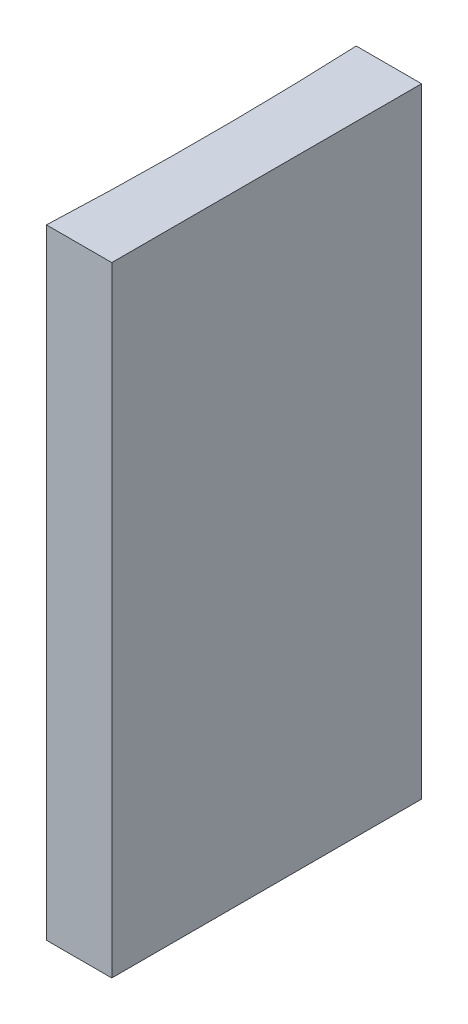
ISO-10303-21;
HEADER;
FILE_DESCRIPTION(('STEP AP214'),'2;1');
FILE_NAME('part.step','',(''),(''),'','','');
FILE_SCHEMA(('AUTOMOTIVE_DESIGN { 1 0 10303 214 1 1 1 1 }'));
ENDSEC;
DATA;
#1=APPLICATION_CONTEXT('core data for automotive mechanical design processes');
#2=APPLICATION_PROTOCOL_DEFINITION('international standard','automotive_design',2000,#1);
#3=PRODUCT_CONTEXT('',#1,'mechanical');
#4=PRODUCT('Part','Part','',(#3));
#5=PRODUCT_RELATED_PRODUCT_CATEGORY('part','',(#4));
#6=PRODUCT_DEFINITION_FORMATION('','',#4);
#7=PRODUCT_DEFINITION_CONTEXT('part definition',#1,'design');
#8=PRODUCT_DEFINITION('design','',#6,#7);
#9=PRODUCT_DEFINITION_SHAPE('','',#8);
#10=(LENGTH_UNIT() NAMED_UNIT(*) SI_UNIT(.MILLI.,.METRE.));
#11=(NAMED_UNIT(*) PLANE_ANGLE_UNIT() SI_UNIT($,.RADIAN.));
#12=(NAMED_UNIT(*) SI_UNIT($,.STERADIAN.) SOLID_ANGLE_UNIT());
#13=UNCERTAINTY_MEASURE_WITH_UNIT(LENGTH_MEASURE(1.E-05),#10,'distance_accuracy_value','');
#14=(GEOMETRIC_REPRESENTATION_CONTEXT(3) GLOBAL_UNCERTAINTY_ASSIGNED_CONTEXT((#13)) GLOBAL_UNIT_ASSIGNED_CONTEXT((#10,
#11,#12)) REPRESENTATION_CONTEXT('',''));
#15=CARTESIAN_POINT('',(0.,0.,0.));
#16=DIRECTION('',(0.,0.,1.));
#17=DIRECTION('',(1.,0.,0.));
#18=AXIS2_PLACEMENT_3D('',#15,#16,#17);
#19=CARTESIAN_POINT('',(0.,20.,0.));
#20=DIRECTION('',(0.,0.,1.));
#21=DIRECTION('',(1.,0.,0.));
#22=AXIS2_PLACEMENT_3D('',#19,#20,#21);
#23=PLANE('',#22);
#24=DIRECTION('',(-1.,0.,0.));
#25=VECTOR('',#24,1.);
#26=CARTESIAN_POINT('',(0.,0.,0.));
#27=LINE('',#26,#25);
#28=CARTESIAN_POINT('',(0.,0.,0.));
#29=VERTEX_POINT('',#28);
#30=CARTESIAN_POINT('',(-2.109107941646,0.,0.));
#31=VERTEX_POINT('',#30);
#32=EDGE_CURVE('E100',#29,#31,#27,.T.);
#33=ORIENTED_EDGE('',*,*,#32,.T.);
#34=DIRECTION('',(0.,-1.,0.));
#35=VECTOR('',#34,1.);
#36=CARTESIAN_POINT('',(-2.109107941646,20.,0.));
#37=LINE('',#36,#35);
#38=CARTESIAN_POINT('',(-2.109107941646,20.,0.));
#39=VERTEX_POINT('',#38);
#40=EDGE_CURVE('E11',#39,#31,#37,.T.);
#41=ORIENTED_EDGE('',*,*,#40,.F.);
#42=DIRECTION('',(-1.,0.,0.));
#43=VECTOR('',#42,1.);
#44=CARTESIAN_POINT('',(0.,20.,0.));
#45=LINE('',#44,#43);
#46=CARTESIAN_POINT('',(0.,20.,0.));
#47=VERTEX_POINT('',#46);
#48=EDGE_CURVE('E88',#47,#39,#45,.T.);
#49=ORIENTED_EDGE('',*,*,#48,.F.);
#50=DIRECTION('',(0.,-1.,0.));
#51=VECTOR('',#50,1.);
#52=CARTESIAN_POINT('',(0.,20.,0.));
#53=LINE('',#52,#51);
#54=EDGE_CURVE('E96',#47,#29,#53,.T.);
#55=ORIENTED_EDGE('',*,*,#54,.T.);
#56=EDGE_LOOP('',(#33,#41,#49,#55));
#57=FACE_BOUND('',#56,.T.);
#58=ADVANCED_FACE('F37',(#57),#23,.F.);
#59=CARTESIAN_POINT('',(-116.62,20.,5.00000000000001));
#60=DIRECTION('',(0.,-1.,0.));
#61=DIRECTION('',(0.,0.,-1.));
#62=AXIS2_PLACEMENT_3D('',#59,#60,#61);
#63=CYLINDRICAL_SURFACE('',#62,114.62);
#64=CARTESIAN_POINT('',(-116.62,0.,5.00000000000001));
#65=DIRECTION('',(0.,-1.,0.));
#66=DIRECTION('',(0.,0.,1.));
#67=AXIS2_PLACEMENT_3D('',#64,#65,#66);
#68=CIRCLE('',#67,114.62);
#69=CARTESIAN_POINT('',(-2.10910794164601,0.,10.));
#70=VERTEX_POINT('',#69);
#71=EDGE_CURVE('E92',#31,#70,#68,.T.);
#72=ORIENTED_EDGE('',*,*,#71,.T.);
#73=DIRECTION('',(0.,-1.,0.));
#74=VECTOR('',#73,1.);
#75=CARTESIAN_POINT('',(-2.10910794164601,20.,10.));
#76=LINE('',#75,#74);
#77=CARTESIAN_POINT('',(-2.10910794164601,20.,10.));
#78=VERTEX_POINT('',#77);
#79=EDGE_CURVE('E45',#78,#70,#76,.T.);
#80=ORIENTED_EDGE('',*,*,#79,.F.);
#81=CARTESIAN_POINT('',(-116.62,20.,5.00000000000001));
#82=DIRECTION('',(0.,-1.,0.));
#83=DIRECTION('',(0.,0.,1.));
#84=AXIS2_PLACEMENT_3D('',#81,#82,#83);
#85=CIRCLE('',#84,114.62);
#86=EDGE_CURVE('E83',#39,#78,#85,.T.);
#87=ORIENTED_EDGE('',*,*,#86,.F.);
#88=ORIENTED_EDGE('',*,*,#40,.T.);
#89=EDGE_LOOP('',(#72,#80,#87,#88));
#90=FACE_BOUND('',#89,.T.);
#91=ADVANCED_FACE('F91',(#90),#63,.F.);
#92=CARTESIAN_POINT('',(0.,20.,10.));
#93=DIRECTION('',(0.,0.,-1.));
#94=DIRECTION('',(-1.,0.,0.));
#95=AXIS2_PLACEMENT_3D('',#92,#93,#94);
#96=PLANE('',#95);
#97=DIRECTION('',(1.,0.,0.));
#98=VECTOR('',#97,1.);
#99=CARTESIAN_POINT('',(0.,0.,10.));
#100=LINE('',#99,#98);
#101=CARTESIAN_POINT('',(0.,0.,10.));
#102=VERTEX_POINT('',#101);
#103=EDGE_CURVE('E70',#70,#102,#100,.T.);
#104=ORIENTED_EDGE('',*,*,#103,.T.);
#105=DIRECTION('',(0.,-1.,0.));
#106=VECTOR('',#105,1.);
#107=CARTESIAN_POINT('',(0.,20.,10.));
#108=LINE('',#107,#106);
#109=CARTESIAN_POINT('',(0.,20.,10.));
#110=VERTEX_POINT('',#109);
#111=EDGE_CURVE('E93',#110,#102,#108,.T.);
#112=ORIENTED_EDGE('',*,*,#111,.F.);
#113=DIRECTION('',(1.,0.,0.));
#114=VECTOR('',#113,1.);
#115=CARTESIAN_POINT('',(0.,20.,10.));
#116=LINE('',#115,#114);
#117=EDGE_CURVE('E86',#78,#110,#116,.T.);
#118=ORIENTED_EDGE('',*,*,#117,.F.);
#119=ORIENTED_EDGE('',*,*,#79,.T.);
#120=EDGE_LOOP('',(#104,#112,#118,#119));
#121=FACE_BOUND('',#120,.T.);
#122=ADVANCED_FACE('F94',(#121),#96,.F.);
#123=CARTESIAN_POINT('',(0.,20.,0.));
#124=DIRECTION('',(-1.,0.,0.));
#125=DIRECTION('',(0.,0.,1.));
#126=AXIS2_PLACEMENT_3D('',#123,#124,#125);
#127=PLANE('',#126);
#128=DIRECTION('',(0.,0.,-1.));
#129=VECTOR('',#128,1.);
#130=CARTESIAN_POINT('',(0.,0.,0.));
#131=LINE('',#130,#129);
#132=EDGE_CURVE('E76',#102,#29,#131,.T.);
#133=ORIENTED_EDGE('',*,*,#132,.T.);
#134=ORIENTED_EDGE('',*,*,#54,.F.);
#135=DIRECTION('',(0.,0.,-1.));
#136=VECTOR('',#135,1.);
#137=CARTESIAN_POINT('',(0.,20.,0.));
#138=LINE('',#137,#136);
#139=EDGE_CURVE('E53',#110,#47,#138,.T.);
#140=ORIENTED_EDGE('',*,*,#139,.F.);
#141=ORIENTED_EDGE('',*,*,#111,.T.);
#142=EDGE_LOOP('',(#133,#134,#140,#141));
#143=FACE_BOUND('',#142,.T.);
#144=ADVANCED_FACE('F107',(#143),#127,.F.);
#145=CARTESIAN_POINT('',(-116.62,20.,5.00000000000001));
#146=DIRECTION('',(0.,1.,0.));
#147=DIRECTION('',(0.,0.,1.));
#148=AXIS2_PLACEMENT_3D('',#145,#146,#147);
#149=PLANE('',#148);
#150=ORIENTED_EDGE('',*,*,#48,.T.);
#151=ORIENTED_EDGE('',*,*,#86,.T.);
#152=ORIENTED_EDGE('',*,*,#117,.T.);
#153=ORIENTED_EDGE('',*,*,#139,.T.);
#154=EDGE_LOOP('',(#150,#151,#152,#153));
#155=FACE_BOUND('',#154,.T.);
#156=ADVANCED_FACE('F84',(#155),#149,.T.);
#157=CARTESIAN_POINT('',(-116.62,0.,5.00000000000001));
#158=DIRECTION('',(0.,1.,0.));
#159=DIRECTION('',(0.,0.,1.));
#160=AXIS2_PLACEMENT_3D('',#157,#158,#159);
#161=PLANE('',#160);
#162=ORIENTED_EDGE('',*,*,#32,.F.);
#163=ORIENTED_EDGE('',*,*,#132,.F.);
#164=ORIENTED_EDGE('',*,*,#103,.F.);
#165=ORIENTED_EDGE('',*,*,#71,.F.);
#166=EDGE_LOOP('',(#162,#163,#164,#165));
#167=FACE_BOUND('',#166,.T.);
#168=ADVANCED_FACE('F110',(#167),#161,.F.);
#169=CLOSED_SHELL('',(#58,#91,#122,#144,#156,#168));
#170=MANIFOLD_SOLID_BREP('B2',#169);
#171=ADVANCED_BREP_SHAPE_REPRESENTATION('',(#18,#170),#14);
#172=SHAPE_DEFINITION_REPRESENTATION(#9,#171);
ENDSEC;
END-ISO-10303-21;
